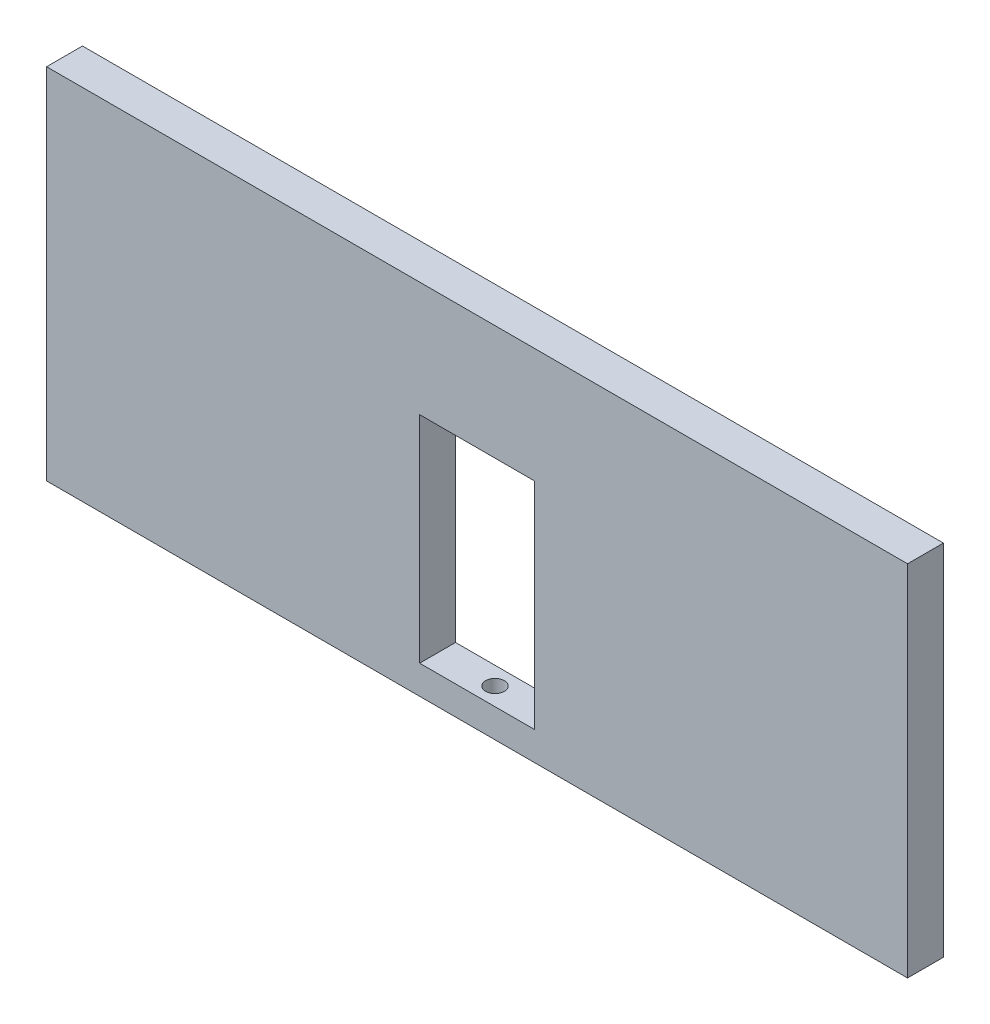
ISO-10303-21;
HEADER;
FILE_DESCRIPTION(('STEP AP214'),'2;1');
FILE_NAME('part.step','',(''),(''),'','','');
FILE_SCHEMA(('AUTOMOTIVE_DESIGN { 1 0 10303 214 1 1 1 1 }'));
ENDSEC;
DATA;
#1=APPLICATION_CONTEXT('core data for automotive mechanical design processes');
#2=APPLICATION_PROTOCOL_DEFINITION('international standard','automotive_design',2000,#1);
#3=PRODUCT_CONTEXT('',#1,'mechanical');
#4=PRODUCT('Part','Part','',(#3));
#5=PRODUCT_RELATED_PRODUCT_CATEGORY('part','',(#4));
#6=PRODUCT_DEFINITION_FORMATION('','',#4);
#7=PRODUCT_DEFINITION_CONTEXT('part definition',#1,'design');
#8=PRODUCT_DEFINITION('design','',#6,#7);
#9=PRODUCT_DEFINITION_SHAPE('','',#8);
#10=(LENGTH_UNIT() NAMED_UNIT(*) SI_UNIT(.MILLI.,.METRE.));
#11=(NAMED_UNIT(*) PLANE_ANGLE_UNIT() SI_UNIT($,.RADIAN.));
#12=(NAMED_UNIT(*) SI_UNIT($,.STERADIAN.) SOLID_ANGLE_UNIT());
#13=UNCERTAINTY_MEASURE_WITH_UNIT(LENGTH_MEASURE(1.E-05),#10,'distance_accuracy_value','');
#14=(GEOMETRIC_REPRESENTATION_CONTEXT(3) GLOBAL_UNCERTAINTY_ASSIGNED_CONTEXT((#13)) GLOBAL_UNIT_ASSIGNED_CONTEXT((#10,
#11,#12)) REPRESENTATION_CONTEXT('',''));
#15=CARTESIAN_POINT('',(0.,0.,0.));
#16=DIRECTION('',(0.,0.,1.));
#17=DIRECTION('',(1.,0.,0.));
#18=AXIS2_PLACEMENT_3D('',#15,#16,#17);
#19=CARTESIAN_POINT('',(0.,0.,25.));
#20=DIRECTION('',(0.,0.,-1.));
#21=DIRECTION('',(-1.,0.,0.));
#22=AXIS2_PLACEMENT_3D('',#19,#20,#21);
#23=PLANE('',#22);
#24=DIRECTION('',(0.,1.,0.));
#25=VECTOR('',#24,1.);
#26=CARTESIAN_POINT('',(300.,-125.,25.));
#27=LINE('',#26,#25);
#28=CARTESIAN_POINT('',(300.,-125.,25.));
#29=VERTEX_POINT('',#28);
#30=CARTESIAN_POINT('',(300.,125.,25.));
#31=VERTEX_POINT('',#30);
#32=EDGE_CURVE('E136',#29,#31,#27,.T.);
#33=ORIENTED_EDGE('',*,*,#32,.T.);
#34=DIRECTION('',(-1.,0.,0.));
#35=VECTOR('',#34,1.);
#36=CARTESIAN_POINT('',(-300.,125.,25.));
#37=LINE('',#36,#35);
#38=CARTESIAN_POINT('',(-300.,125.,25.));
#39=VERTEX_POINT('',#38);
#40=EDGE_CURVE('E139',#31,#39,#37,.T.);
#41=ORIENTED_EDGE('',*,*,#40,.T.);
#42=DIRECTION('',(0.,-1.,0.));
#43=VECTOR('',#42,1.);
#44=CARTESIAN_POINT('',(-300.,-125.,25.));
#45=LINE('',#44,#43);
#46=CARTESIAN_POINT('',(-300.,-125.,25.));
#47=VERTEX_POINT('',#46);
#48=EDGE_CURVE('E142',#39,#47,#45,.T.);
#49=ORIENTED_EDGE('',*,*,#48,.T.);
#50=DIRECTION('',(1.,0.,0.));
#51=VECTOR('',#50,1.);
#52=CARTESIAN_POINT('',(-300.,-125.,25.));
#53=LINE('',#52,#51);
#54=EDGE_CURVE('E144',#47,#29,#53,.T.);
#55=ORIENTED_EDGE('',*,*,#54,.T.);
#56=EDGE_LOOP('',(#33,#41,#49,#55));
#57=FACE_BOUND('',#56,.T.);
#58=DIRECTION('',(0.,-1.,0.));
#59=VECTOR('',#58,1.);
#60=CARTESIAN_POINT('',(-40.,-105.,25.));
#61=LINE('',#60,#59);
#62=CARTESIAN_POINT('',(-40.,45.,25.));
#63=VERTEX_POINT('',#62);
#64=CARTESIAN_POINT('',(-40.,-105.,25.));
#65=VERTEX_POINT('',#64);
#66=EDGE_CURVE('E98',#63,#65,#61,.T.);
#67=ORIENTED_EDGE('',*,*,#66,.F.);
#68=DIRECTION('',(-1.,0.,0.));
#69=VECTOR('',#68,1.);
#70=CARTESIAN_POINT('',(40.,45.,25.));
#71=LINE('',#70,#69);
#72=CARTESIAN_POINT('',(40.,45.,25.));
#73=VERTEX_POINT('',#72);
#74=EDGE_CURVE('E120',#73,#63,#71,.T.);
#75=ORIENTED_EDGE('',*,*,#74,.F.);
#76=DIRECTION('',(0.,1.,0.));
#77=VECTOR('',#76,1.);
#78=CARTESIAN_POINT('',(40.,-105.,25.));
#79=LINE('',#78,#77);
#80=CARTESIAN_POINT('',(40.,-105.,25.));
#81=VERTEX_POINT('',#80);
#82=EDGE_CURVE('E118',#81,#73,#79,.T.);
#83=ORIENTED_EDGE('',*,*,#82,.F.);
#84=DIRECTION('',(1.,0.,0.));
#85=VECTOR('',#84,1.);
#86=CARTESIAN_POINT('',(-40.,-105.,25.));
#87=LINE('',#86,#85);
#88=EDGE_CURVE('E106',#65,#81,#87,.T.);
#89=ORIENTED_EDGE('',*,*,#88,.F.);
#90=EDGE_LOOP('',(#67,#75,#83,#89));
#91=FACE_BOUND('',#90,.T.);
#92=ADVANCED_FACE('F33',(#57,#91),#23,.F.);
#93=CARTESIAN_POINT('',(0.,0.,0.));
#94=DIRECTION('',(0.,0.,-1.));
#95=DIRECTION('',(-1.,0.,0.));
#96=AXIS2_PLACEMENT_3D('',#93,#94,#95);
#97=PLANE('',#96);
#98=DIRECTION('',(0.,1.,0.));
#99=VECTOR('',#98,1.);
#100=CARTESIAN_POINT('',(300.,-125.,0.));
#101=LINE('',#100,#99);
#102=CARTESIAN_POINT('',(300.,-125.,0.));
#103=VERTEX_POINT('',#102);
#104=CARTESIAN_POINT('',(300.,125.,0.));
#105=VERTEX_POINT('',#104);
#106=EDGE_CURVE('E114',#103,#105,#101,.T.);
#107=ORIENTED_EDGE('',*,*,#106,.F.);
#108=DIRECTION('',(1.,0.,0.));
#109=VECTOR('',#108,1.);
#110=CARTESIAN_POINT('',(-300.,-125.,0.));
#111=LINE('',#110,#109);
#112=CARTESIAN_POINT('',(-300.,-125.,0.));
#113=VERTEX_POINT('',#112);
#114=EDGE_CURVE('E140',#113,#103,#111,.T.);
#115=ORIENTED_EDGE('',*,*,#114,.F.);
#116=DIRECTION('',(0.,-1.,0.));
#117=VECTOR('',#116,1.);
#118=CARTESIAN_POINT('',(-300.,-125.,0.));
#119=LINE('',#118,#117);
#120=CARTESIAN_POINT('',(-300.,125.,0.));
#121=VERTEX_POINT('',#120);
#122=EDGE_CURVE('E151',#121,#113,#119,.T.);
#123=ORIENTED_EDGE('',*,*,#122,.F.);
#124=DIRECTION('',(-1.,0.,0.));
#125=VECTOR('',#124,1.);
#126=CARTESIAN_POINT('',(-300.,125.,0.));
#127=LINE('',#126,#125);
#128=EDGE_CURVE('E149',#105,#121,#127,.T.);
#129=ORIENTED_EDGE('',*,*,#128,.F.);
#130=EDGE_LOOP('',(#107,#115,#123,#129));
#131=FACE_BOUND('',#130,.T.);
#132=DIRECTION('',(-1.,0.,0.));
#133=VECTOR('',#132,1.);
#134=CARTESIAN_POINT('',(40.,45.,0.));
#135=LINE('',#134,#133);
#136=CARTESIAN_POINT('',(40.,45.,0.));
#137=VERTEX_POINT('',#136);
#138=CARTESIAN_POINT('',(-40.,45.,0.));
#139=VERTEX_POINT('',#138);
#140=EDGE_CURVE('E107',#137,#139,#135,.T.);
#141=ORIENTED_EDGE('',*,*,#140,.T.);
#142=DIRECTION('',(0.,-1.,0.));
#143=VECTOR('',#142,1.);
#144=CARTESIAN_POINT('',(-40.,-105.,0.));
#145=LINE('',#144,#143);
#146=CARTESIAN_POINT('',(-40.,-105.,0.));
#147=VERTEX_POINT('',#146);
#148=EDGE_CURVE('E56',#139,#147,#145,.T.);
#149=ORIENTED_EDGE('',*,*,#148,.T.);
#150=DIRECTION('',(1.,0.,0.));
#151=VECTOR('',#150,1.);
#152=CARTESIAN_POINT('',(-40.,-105.,0.));
#153=LINE('',#152,#151);
#154=CARTESIAN_POINT('',(40.,-105.,0.));
#155=VERTEX_POINT('',#154);
#156=EDGE_CURVE('E113',#147,#155,#153,.T.);
#157=ORIENTED_EDGE('',*,*,#156,.T.);
#158=DIRECTION('',(0.,1.,0.));
#159=VECTOR('',#158,1.);
#160=CARTESIAN_POINT('',(40.,-105.,0.));
#161=LINE('',#160,#159);
#162=EDGE_CURVE('E128',#155,#137,#161,.T.);
#163=ORIENTED_EDGE('',*,*,#162,.T.);
#164=EDGE_LOOP('',(#141,#149,#157,#163));
#165=FACE_BOUND('',#164,.T.);
#166=ADVANCED_FACE('F169',(#131,#165),#97,.T.);
#167=CARTESIAN_POINT('',(300.,-125.,25.));
#168=DIRECTION('',(-1.,0.,0.));
#169=DIRECTION('',(0.,0.,1.));
#170=AXIS2_PLACEMENT_3D('',#167,#168,#169);
#171=PLANE('',#170);
#172=ORIENTED_EDGE('',*,*,#106,.T.);
#173=DIRECTION('',(0.,0.,-1.));
#174=VECTOR('',#173,1.);
#175=CARTESIAN_POINT('',(300.,125.,25.));
#176=LINE('',#175,#174);
#177=EDGE_CURVE('E11',#31,#105,#176,.T.);
#178=ORIENTED_EDGE('',*,*,#177,.F.);
#179=ORIENTED_EDGE('',*,*,#32,.F.);
#180=DIRECTION('',(0.,0.,-1.));
#181=VECTOR('',#180,1.);
#182=CARTESIAN_POINT('',(300.,-125.,25.));
#183=LINE('',#182,#181);
#184=EDGE_CURVE('E146',#29,#103,#183,.T.);
#185=ORIENTED_EDGE('',*,*,#184,.T.);
#186=EDGE_LOOP('',(#172,#178,#179,#185));
#187=FACE_BOUND('',#186,.T.);
#188=ADVANCED_FACE('F35',(#187),#171,.F.);
#189=CARTESIAN_POINT('',(-300.,125.,25.));
#190=DIRECTION('',(0.,-1.,0.));
#191=DIRECTION('',(0.,0.,-1.));
#192=AXIS2_PLACEMENT_3D('',#189,#190,#191);
#193=PLANE('',#192);
#194=ORIENTED_EDGE('',*,*,#128,.T.);
#195=DIRECTION('',(0.,0.,-1.));
#196=VECTOR('',#195,1.);
#197=CARTESIAN_POINT('',(-300.,125.,25.));
#198=LINE('',#197,#196);
#199=EDGE_CURVE('E41',#39,#121,#198,.T.);
#200=ORIENTED_EDGE('',*,*,#199,.F.);
#201=ORIENTED_EDGE('',*,*,#40,.F.);
#202=ORIENTED_EDGE('',*,*,#177,.T.);
#203=EDGE_LOOP('',(#194,#200,#201,#202));
#204=FACE_BOUND('',#203,.T.);
#205=ADVANCED_FACE('F179',(#204),#193,.F.);
#206=CARTESIAN_POINT('',(-300.,-125.,25.));
#207=DIRECTION('',(1.,0.,0.));
#208=DIRECTION('',(0.,0.,-1.));
#209=AXIS2_PLACEMENT_3D('',#206,#207,#208);
#210=PLANE('',#209);
#211=ORIENTED_EDGE('',*,*,#122,.T.);
#212=DIRECTION('',(0.,0.,-1.));
#213=VECTOR('',#212,1.);
#214=CARTESIAN_POINT('',(-300.,-125.,25.));
#215=LINE('',#214,#213);
#216=EDGE_CURVE('E156',#47,#113,#215,.T.);
#217=ORIENTED_EDGE('',*,*,#216,.F.);
#218=ORIENTED_EDGE('',*,*,#48,.F.);
#219=ORIENTED_EDGE('',*,*,#199,.T.);
#220=EDGE_LOOP('',(#211,#217,#218,#219));
#221=FACE_BOUND('',#220,.T.);
#222=ADVANCED_FACE('F163',(#221),#210,.F.);
#223=CARTESIAN_POINT('',(-300.,-125.,25.));
#224=DIRECTION('',(0.,1.,0.));
#225=DIRECTION('',(0.,0.,1.));
#226=AXIS2_PLACEMENT_3D('',#223,#224,#225);
#227=PLANE('',#226);
#228=CARTESIAN_POINT('',(0.,-125.,12.5));
#229=DIRECTION('',(0.,-1.,0.));
#230=DIRECTION('',(0.,0.,-1.));
#231=AXIS2_PLACEMENT_3D('',#228,#229,#230);
#232=CIRCLE('',#231,6.5);
#233=CARTESIAN_POINT('',(0.,-125.,6.));
#234=VERTEX_POINT('',#233);
#235=EDGE_CURVE('E126',#234,#234,#232,.T.);
#236=ORIENTED_EDGE('',*,*,#235,.F.);
#237=EDGE_LOOP('',(#236));
#238=FACE_BOUND('',#237,.T.);
#239=ORIENTED_EDGE('',*,*,#114,.T.);
#240=ORIENTED_EDGE('',*,*,#184,.F.);
#241=ORIENTED_EDGE('',*,*,#54,.F.);
#242=ORIENTED_EDGE('',*,*,#216,.T.);
#243=EDGE_LOOP('',(#239,#240,#241,#242));
#244=FACE_BOUND('',#243,.T.);
#245=ADVANCED_FACE('F173',(#238,#244),#227,.F.);
#246=CARTESIAN_POINT('',(-40.,-105.,25.));
#247=DIRECTION('',(1.,0.,0.));
#248=DIRECTION('',(0.,1.,0.));
#249=AXIS2_PLACEMENT_3D('',#246,#247,#248);
#250=PLANE('',#249);
#251=ORIENTED_EDGE('',*,*,#148,.F.);
#252=DIRECTION('',(0.,0.,-1.));
#253=VECTOR('',#252,1.);
#254=CARTESIAN_POINT('',(-40.,45.,25.));
#255=LINE('',#254,#253);
#256=EDGE_CURVE('E102',#63,#139,#255,.T.);
#257=ORIENTED_EDGE('',*,*,#256,.F.);
#258=ORIENTED_EDGE('',*,*,#66,.T.);
#259=DIRECTION('',(0.,0.,-1.));
#260=VECTOR('',#259,1.);
#261=CARTESIAN_POINT('',(-40.,-105.,25.));
#262=LINE('',#261,#260);
#263=EDGE_CURVE('E101',#65,#147,#262,.T.);
#264=ORIENTED_EDGE('',*,*,#263,.T.);
#265=EDGE_LOOP('',(#251,#257,#258,#264));
#266=FACE_BOUND('',#265,.T.);
#267=ADVANCED_FACE('F100',(#266),#250,.T.);
#268=CARTESIAN_POINT('',(-40.,-105.,25.));
#269=DIRECTION('',(0.,1.,0.));
#270=DIRECTION('',(0.,0.,1.));
#271=AXIS2_PLACEMENT_3D('',#268,#269,#270);
#272=PLANE('',#271);
#273=CARTESIAN_POINT('',(0.,-105.,12.5));
#274=DIRECTION('',(0.,1.,0.));
#275=DIRECTION('',(0.,0.,1.));
#276=AXIS2_PLACEMENT_3D('',#273,#274,#275);
#277=CIRCLE('',#276,6.5);
#278=CARTESIAN_POINT('',(0.,-105.,19.));
#279=VERTEX_POINT('',#278);
#280=EDGE_CURVE('E203',#279,#279,#277,.F.);
#281=ORIENTED_EDGE('',*,*,#280,.T.);
#282=EDGE_LOOP('',(#281));
#283=FACE_BOUND('',#282,.T.);
#284=ORIENTED_EDGE('',*,*,#156,.F.);
#285=ORIENTED_EDGE('',*,*,#263,.F.);
#286=ORIENTED_EDGE('',*,*,#88,.T.);
#287=DIRECTION('',(0.,0.,-1.));
#288=VECTOR('',#287,1.);
#289=CARTESIAN_POINT('',(40.,-105.,25.));
#290=LINE('',#289,#288);
#291=EDGE_CURVE('E115',#81,#155,#290,.T.);
#292=ORIENTED_EDGE('',*,*,#291,.T.);
#293=EDGE_LOOP('',(#284,#285,#286,#292));
#294=FACE_BOUND('',#293,.T.);
#295=ADVANCED_FACE('F110',(#283,#294),#272,.T.);
#296=CARTESIAN_POINT('',(40.,-105.,25.));
#297=DIRECTION('',(-1.,0.,0.));
#298=DIRECTION('',(0.,-1.,0.));
#299=AXIS2_PLACEMENT_3D('',#296,#297,#298);
#300=PLANE('',#299);
#301=ORIENTED_EDGE('',*,*,#162,.F.);
#302=ORIENTED_EDGE('',*,*,#291,.F.);
#303=ORIENTED_EDGE('',*,*,#82,.T.);
#304=DIRECTION('',(0.,0.,-1.));
#305=VECTOR('',#304,1.);
#306=CARTESIAN_POINT('',(40.,45.,25.));
#307=LINE('',#306,#305);
#308=EDGE_CURVE('E48',#73,#137,#307,.T.);
#309=ORIENTED_EDGE('',*,*,#308,.T.);
#310=EDGE_LOOP('',(#301,#302,#303,#309));
#311=FACE_BOUND('',#310,.T.);
#312=ADVANCED_FACE('F216',(#311),#300,.T.);
#313=CARTESIAN_POINT('',(40.,45.,25.));
#314=DIRECTION('',(0.,-1.,0.));
#315=DIRECTION('',(0.,0.,-1.));
#316=AXIS2_PLACEMENT_3D('',#313,#314,#315);
#317=PLANE('',#316);
#318=ORIENTED_EDGE('',*,*,#140,.F.);
#319=ORIENTED_EDGE('',*,*,#308,.F.);
#320=ORIENTED_EDGE('',*,*,#74,.T.);
#321=ORIENTED_EDGE('',*,*,#256,.T.);
#322=EDGE_LOOP('',(#318,#319,#320,#321));
#323=FACE_BOUND('',#322,.T.);
#324=ADVANCED_FACE('F211',(#323),#317,.T.);
#325=CARTESIAN_POINT('',(0.,125.001,12.5));
#326=DIRECTION('',(0.,-1.,0.));
#327=DIRECTION('',(0.,0.,-1.));
#328=AXIS2_PLACEMENT_3D('',#325,#326,#327);
#329=CYLINDRICAL_SURFACE('',#328,6.5);
#330=ORIENTED_EDGE('',*,*,#280,.F.);
#331=EDGE_LOOP('',(#330));
#332=FACE_BOUND('',#331,.T.);
#333=ORIENTED_EDGE('',*,*,#235,.T.);
#334=EDGE_LOOP('',(#333));
#335=FACE_BOUND('',#334,.T.);
#336=ADVANCED_FACE('F209',(#332,#335),#329,.F.);
#337=CLOSED_SHELL('',(#92,#166,#188,#205,#222,#245,#267,#295,#312,#324,#336));
#338=MANIFOLD_SOLID_BREP('B2',#337);
#339=ADVANCED_BREP_SHAPE_REPRESENTATION('',(#18,#338),#14);
#340=SHAPE_DEFINITION_REPRESENTATION(#9,#339);
ENDSEC;
END-ISO-10303-21;
